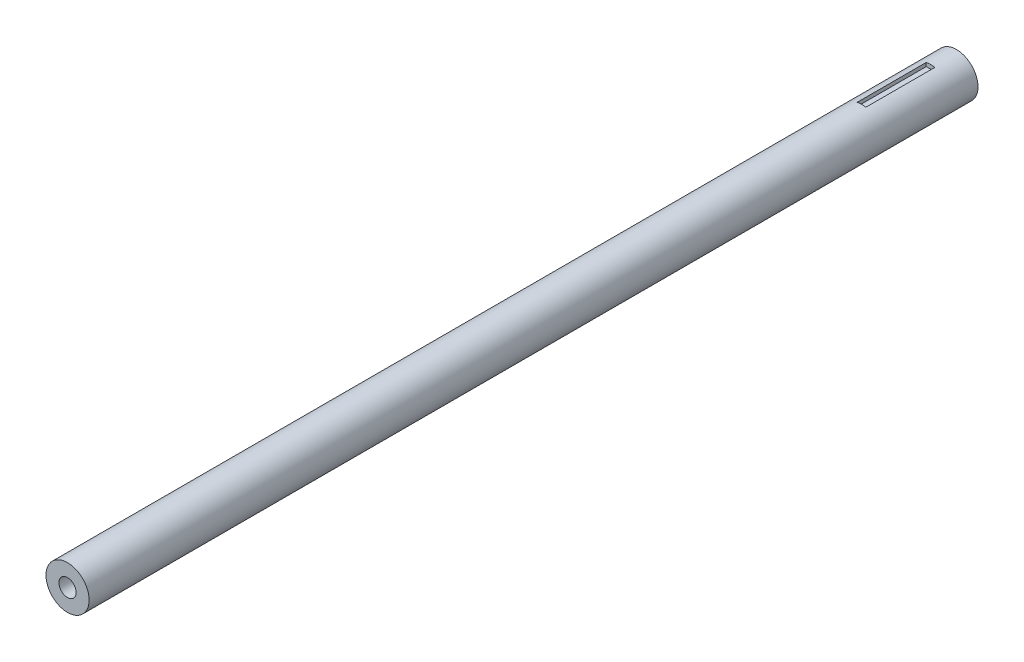
ISO-10303-21;
HEADER;
FILE_DESCRIPTION(('STEP AP214'),'2;1');
FILE_NAME('part.step','',(''),(''),'','','');
FILE_SCHEMA(('AUTOMOTIVE_DESIGN { 1 0 10303 214 1 1 1 1 }'));
ENDSEC;
DATA;
#1=APPLICATION_CONTEXT('core data for automotive mechanical design processes');
#2=APPLICATION_PROTOCOL_DEFINITION('international standard','automotive_design',2000,#1);
#3=PRODUCT_CONTEXT('',#1,'mechanical');
#4=PRODUCT('Part','Part','',(#3));
#5=PRODUCT_RELATED_PRODUCT_CATEGORY('part','',(#4));
#6=PRODUCT_DEFINITION_FORMATION('','',#4);
#7=PRODUCT_DEFINITION_CONTEXT('part definition',#1,'design');
#8=PRODUCT_DEFINITION('design','',#6,#7);
#9=PRODUCT_DEFINITION_SHAPE('','',#8);
#10=(LENGTH_UNIT() NAMED_UNIT(*) SI_UNIT(.MILLI.,.METRE.));
#11=(NAMED_UNIT(*) PLANE_ANGLE_UNIT() SI_UNIT($,.RADIAN.));
#12=(NAMED_UNIT(*) SI_UNIT($,.STERADIAN.) SOLID_ANGLE_UNIT());
#13=UNCERTAINTY_MEASURE_WITH_UNIT(LENGTH_MEASURE(1.E-05),#10,'distance_accuracy_value','');
#14=(GEOMETRIC_REPRESENTATION_CONTEXT(3) GLOBAL_UNCERTAINTY_ASSIGNED_CONTEXT((#13)) GLOBAL_UNIT_ASSIGNED_CONTEXT((#10,
#11,#12)) REPRESENTATION_CONTEXT('',''));
#15=CARTESIAN_POINT('',(0.,0.,0.));
#16=DIRECTION('',(0.,0.,1.));
#17=DIRECTION('',(1.,0.,0.));
#18=AXIS2_PLACEMENT_3D('',#15,#16,#17);
#19=CARTESIAN_POINT('',(0.,0.,136.525));
#20=DIRECTION('',(0.,0.,-1.));
#21=DIRECTION('',(-1.,0.,0.));
#22=AXIS2_PLACEMENT_3D('',#19,#20,#21);
#23=CYLINDRICAL_SURFACE('',#22,7.9375);
#24=CARTESIAN_POINT('',(0.,0.,-190.5));
#25=DIRECTION('',(0.,0.,1.));
#26=DIRECTION('',(1.,0.,0.));
#27=AXIS2_PLACEMENT_3D('',#24,#25,#26);
#28=CIRCLE('',#27,7.9375);
#29=CARTESIAN_POINT('',(7.9375,0.,-190.5));
#30=VERTEX_POINT('',#29);
#31=EDGE_CURVE('E103',#30,#30,#28,.T.);
#32=ORIENTED_EDGE('',*,*,#31,.T.);
#33=EDGE_LOOP('',(#32));
#34=FACE_BOUND('',#33,.T.);
#35=CARTESIAN_POINT('',(0.,0.,136.525));
#36=DIRECTION('',(0.,0.,1.));
#37=DIRECTION('',(1.,0.,0.));
#38=AXIS2_PLACEMENT_3D('',#35,#36,#37);
#39=CIRCLE('',#38,7.9375);
#40=CARTESIAN_POINT('',(7.9375,0.,136.525));
#41=VERTEX_POINT('',#40);
#42=EDGE_CURVE('E108',#41,#41,#39,.T.);
#43=ORIENTED_EDGE('',*,*,#42,.F.);
#44=EDGE_LOOP('',(#43));
#45=FACE_BOUND('',#44,.T.);
#46=DIRECTION('',(0.,0.,-1.));
#47=VECTOR('',#46,1.);
#48=CARTESIAN_POINT('',(-1.5875,7.77712993333659,136.525));
#49=LINE('',#48,#47);
#50=CARTESIAN_POINT('',(-1.5875,7.77712993333659,-180.975));
#51=VERTEX_POINT('',#50);
#52=CARTESIAN_POINT('',(-1.5875,7.77712993333659,-155.575));
#53=VERTEX_POINT('',#52);
#54=EDGE_CURVE('E11',#51,#53,#49,.F.);
#55=ORIENTED_EDGE('',*,*,#54,.F.);
#56=CARTESIAN_POINT('',(0.,0.,-180.975));
#57=DIRECTION('',(0.,0.,-1.));
#58=DIRECTION('',(-1.,0.,0.));
#59=AXIS2_PLACEMENT_3D('',#56,#57,#58);
#60=CIRCLE('',#59,7.9375);
#61=CARTESIAN_POINT('',(1.5875,7.77712993333659,-180.975));
#62=VERTEX_POINT('',#61);
#63=EDGE_CURVE('E53',#51,#62,#60,.T.);
#64=ORIENTED_EDGE('',*,*,#63,.T.);
#65=DIRECTION('',(0.,0.,-1.));
#66=VECTOR('',#65,1.);
#67=CARTESIAN_POINT('',(1.5875,7.77712993333659,136.525));
#68=LINE('',#67,#66);
#69=CARTESIAN_POINT('',(1.5875,7.77712993333659,-155.575));
#70=VERTEX_POINT('',#69);
#71=EDGE_CURVE('E111',#62,#70,#68,.F.);
#72=ORIENTED_EDGE('',*,*,#71,.T.);
#73=CARTESIAN_POINT('',(0.,0.,-155.575));
#74=DIRECTION('',(0.,0.,1.));
#75=DIRECTION('',(1.,0.,0.));
#76=AXIS2_PLACEMENT_3D('',#73,#74,#75);
#77=CIRCLE('',#76,7.9375);
#78=EDGE_CURVE('E38',#70,#53,#77,.T.);
#79=ORIENTED_EDGE('',*,*,#78,.T.);
#80=EDGE_LOOP('',(#55,#64,#72,#79));
#81=FACE_BOUND('',#80,.T.);
#82=ADVANCED_FACE('F31',(#34,#45,#81),#23,.T.);
#83=CARTESIAN_POINT('',(0.,0.,136.525));
#84=DIRECTION('',(0.,0.,1.));
#85=DIRECTION('',(1.,0.,0.));
#86=AXIS2_PLACEMENT_3D('',#83,#84,#85);
#87=PLANE('',#86);
#88=CARTESIAN_POINT('',(0.,0.,136.525));
#89=DIRECTION('',(0.,0.,1.));
#90=DIRECTION('',(1.,0.,0.));
#91=AXIS2_PLACEMENT_3D('',#88,#89,#90);
#92=CIRCLE('',#91,3.175);
#93=CARTESIAN_POINT('',(3.175,0.,136.525));
#94=VERTEX_POINT('',#93);
#95=EDGE_CURVE('E98',#94,#94,#92,.T.);
#96=ORIENTED_EDGE('',*,*,#95,.F.);
#97=EDGE_LOOP('',(#96));
#98=FACE_BOUND('',#97,.T.);
#99=ORIENTED_EDGE('',*,*,#42,.T.);
#100=EDGE_LOOP('',(#99));
#101=FACE_BOUND('',#100,.T.);
#102=ADVANCED_FACE('F130',(#98,#101),#87,.T.);
#103=CARTESIAN_POINT('',(0.,0.,-190.5));
#104=DIRECTION('',(0.,0.,1.));
#105=DIRECTION('',(1.,0.,0.));
#106=AXIS2_PLACEMENT_3D('',#103,#104,#105);
#107=PLANE('',#106);
#108=ORIENTED_EDGE('',*,*,#31,.F.);
#109=EDGE_LOOP('',(#108));
#110=FACE_BOUND('',#109,.T.);
#111=ADVANCED_FACE('F135',(#110),#107,.F.);
#112=CARTESIAN_POINT('',(0.,0.,111.125));
#113=DIRECTION('',(0.,0.,1.));
#114=DIRECTION('',(1.,0.,0.));
#115=AXIS2_PLACEMENT_3D('',#112,#113,#114);
#116=CYLINDRICAL_SURFACE('',#115,3.175);
#117=CARTESIAN_POINT('',(0.,0.,111.125));
#118=DIRECTION('',(0.,0.,1.));
#119=DIRECTION('',(1.,0.,0.));
#120=AXIS2_PLACEMENT_3D('',#117,#118,#119);
#121=CIRCLE('',#120,3.175);
#122=CARTESIAN_POINT('',(3.175,0.,111.125));
#123=VERTEX_POINT('',#122);
#124=EDGE_CURVE('E100',#123,#123,#121,.T.);
#125=ORIENTED_EDGE('',*,*,#124,.F.);
#126=EDGE_LOOP('',(#125));
#127=FACE_BOUND('',#126,.T.);
#128=ORIENTED_EDGE('',*,*,#95,.T.);
#129=EDGE_LOOP('',(#128));
#130=FACE_BOUND('',#129,.T.);
#131=ADVANCED_FACE('F143',(#127,#130),#116,.F.);
#132=CARTESIAN_POINT('',(0.,0.,111.125));
#133=DIRECTION('',(0.,0.,1.));
#134=DIRECTION('',(1.,0.,0.));
#135=AXIS2_PLACEMENT_3D('',#132,#133,#134);
#136=PLANE('',#135);
#137=ORIENTED_EDGE('',*,*,#124,.T.);
#138=EDGE_LOOP('',(#137));
#139=FACE_BOUND('',#138,.T.);
#140=ADVANCED_FACE('F125',(#139),#136,.T.);
#141=CARTESIAN_POINT('',(-1.5875,9.6139,-155.575));
#142=DIRECTION('',(0.,0.,1.));
#143=DIRECTION('',(1.,0.,0.));
#144=AXIS2_PLACEMENT_3D('',#141,#142,#143);
#145=PLANE('',#144);
#146=DIRECTION('',(0.,-1.,0.));
#147=VECTOR('',#146,1.);
#148=CARTESIAN_POINT('',(1.5875,9.6139,-155.575));
#149=LINE('',#148,#147);
#150=CARTESIAN_POINT('',(1.5875,6.4389,-155.575));
#151=VERTEX_POINT('',#150);
#152=EDGE_CURVE('E45',#70,#151,#149,.T.);
#153=ORIENTED_EDGE('',*,*,#152,.T.);
#154=DIRECTION('',(1.,0.,0.));
#155=VECTOR('',#154,1.);
#156=CARTESIAN_POINT('',(-1.5875,6.4389,-155.575));
#157=LINE('',#156,#155);
#158=CARTESIAN_POINT('',(-1.5875,6.4389,-155.575));
#159=VERTEX_POINT('',#158);
#160=EDGE_CURVE('E83',#159,#151,#157,.T.);
#161=ORIENTED_EDGE('',*,*,#160,.F.);
#162=DIRECTION('',(0.,-1.,0.));
#163=VECTOR('',#162,1.);
#164=CARTESIAN_POINT('',(-1.5875,9.6139,-155.575));
#165=LINE('',#164,#163);
#166=EDGE_CURVE('E72',#53,#159,#165,.T.);
#167=ORIENTED_EDGE('',*,*,#166,.F.);
#168=ORIENTED_EDGE('',*,*,#78,.F.);
#169=EDGE_LOOP('',(#153,#161,#167,#168));
#170=FACE_BOUND('',#169,.T.);
#171=ADVANCED_FACE('F84',(#170),#145,.F.);
#172=CARTESIAN_POINT('',(-1.5875,9.6139,-180.975));
#173=DIRECTION('',(0.,0.,-1.));
#174=DIRECTION('',(-1.,0.,0.));
#175=AXIS2_PLACEMENT_3D('',#172,#173,#174);
#176=PLANE('',#175);
#177=DIRECTION('',(0.,1.,0.));
#178=VECTOR('',#177,1.);
#179=CARTESIAN_POINT('',(-1.5875,9.6139,-180.975));
#180=LINE('',#179,#178);
#181=CARTESIAN_POINT('',(-1.5875,6.4389,-180.975));
#182=VERTEX_POINT('',#181);
#183=EDGE_CURVE('E88',#182,#51,#180,.T.);
#184=ORIENTED_EDGE('',*,*,#183,.F.);
#185=DIRECTION('',(1.,0.,0.));
#186=VECTOR('',#185,1.);
#187=CARTESIAN_POINT('',(-1.5875,6.4389,-180.975));
#188=LINE('',#187,#186);
#189=CARTESIAN_POINT('',(1.5875,6.4389,-180.975));
#190=VERTEX_POINT('',#189);
#191=EDGE_CURVE('E87',#182,#190,#188,.T.);
#192=ORIENTED_EDGE('',*,*,#191,.T.);
#193=DIRECTION('',(0.,1.,0.));
#194=VECTOR('',#193,1.);
#195=CARTESIAN_POINT('',(1.5875,9.6139,-180.975));
#196=LINE('',#195,#194);
#197=EDGE_CURVE('E80',#190,#62,#196,.T.);
#198=ORIENTED_EDGE('',*,*,#197,.T.);
#199=ORIENTED_EDGE('',*,*,#63,.F.);
#200=EDGE_LOOP('',(#184,#192,#198,#199));
#201=FACE_BOUND('',#200,.T.);
#202=ADVANCED_FACE('F117',(#201),#176,.F.);
#203=CARTESIAN_POINT('',(-1.5875,6.4389,-155.575));
#204=DIRECTION('',(1.,0.,0.));
#205=DIRECTION('',(0.,0.,-1.));
#206=AXIS2_PLACEMENT_3D('',#203,#204,#205);
#207=PLANE('',#206);
#208=ORIENTED_EDGE('',*,*,#54,.T.);
#209=ORIENTED_EDGE('',*,*,#166,.T.);
#210=DIRECTION('',(0.,0.,-1.));
#211=VECTOR('',#210,1.);
#212=CARTESIAN_POINT('',(-1.5875,6.4389,-155.575));
#213=LINE('',#212,#211);
#214=EDGE_CURVE('E76',#159,#182,#213,.T.);
#215=ORIENTED_EDGE('',*,*,#214,.T.);
#216=ORIENTED_EDGE('',*,*,#183,.T.);
#217=EDGE_LOOP('',(#208,#209,#215,#216));
#218=FACE_BOUND('',#217,.T.);
#219=ADVANCED_FACE('F74',(#218),#207,.T.);
#220=CARTESIAN_POINT('',(1.5875,6.4389,-155.575));
#221=DIRECTION('',(1.,0.,0.));
#222=DIRECTION('',(0.,0.,-1.));
#223=AXIS2_PLACEMENT_3D('',#220,#221,#222);
#224=PLANE('',#223);
#225=ORIENTED_EDGE('',*,*,#197,.F.);
#226=DIRECTION('',(0.,0.,-1.));
#227=VECTOR('',#226,1.);
#228=CARTESIAN_POINT('',(1.5875,6.4389,-155.575));
#229=LINE('',#228,#227);
#230=EDGE_CURVE('E95',#151,#190,#229,.T.);
#231=ORIENTED_EDGE('',*,*,#230,.F.);
#232=ORIENTED_EDGE('',*,*,#152,.F.);
#233=ORIENTED_EDGE('',*,*,#71,.F.);
#234=EDGE_LOOP('',(#225,#231,#232,#233));
#235=FACE_BOUND('',#234,.T.);
#236=ADVANCED_FACE('F116',(#235),#224,.F.);
#237=CARTESIAN_POINT('',(-1.5875,6.4389,-155.575));
#238=DIRECTION('',(0.,-1.,0.));
#239=DIRECTION('',(0.,0.,-1.));
#240=AXIS2_PLACEMENT_3D('',#237,#238,#239);
#241=PLANE('',#240);
#242=ORIENTED_EDGE('',*,*,#230,.T.);
#243=ORIENTED_EDGE('',*,*,#191,.F.);
#244=ORIENTED_EDGE('',*,*,#214,.F.);
#245=ORIENTED_EDGE('',*,*,#160,.T.);
#246=EDGE_LOOP('',(#242,#243,#244,#245));
#247=FACE_BOUND('',#246,.T.);
#248=ADVANCED_FACE('F90',(#247),#241,.F.);
#249=CLOSED_SHELL('',(#82,#102,#111,#131,#140,#171,#202,#219,#236,#248));
#250=MANIFOLD_SOLID_BREP('B2',#249);
#251=ADVANCED_BREP_SHAPE_REPRESENTATION('',(#18,#250),#14);
#252=SHAPE_DEFINITION_REPRESENTATION(#9,#251);
ENDSEC;
END-ISO-10303-21;
